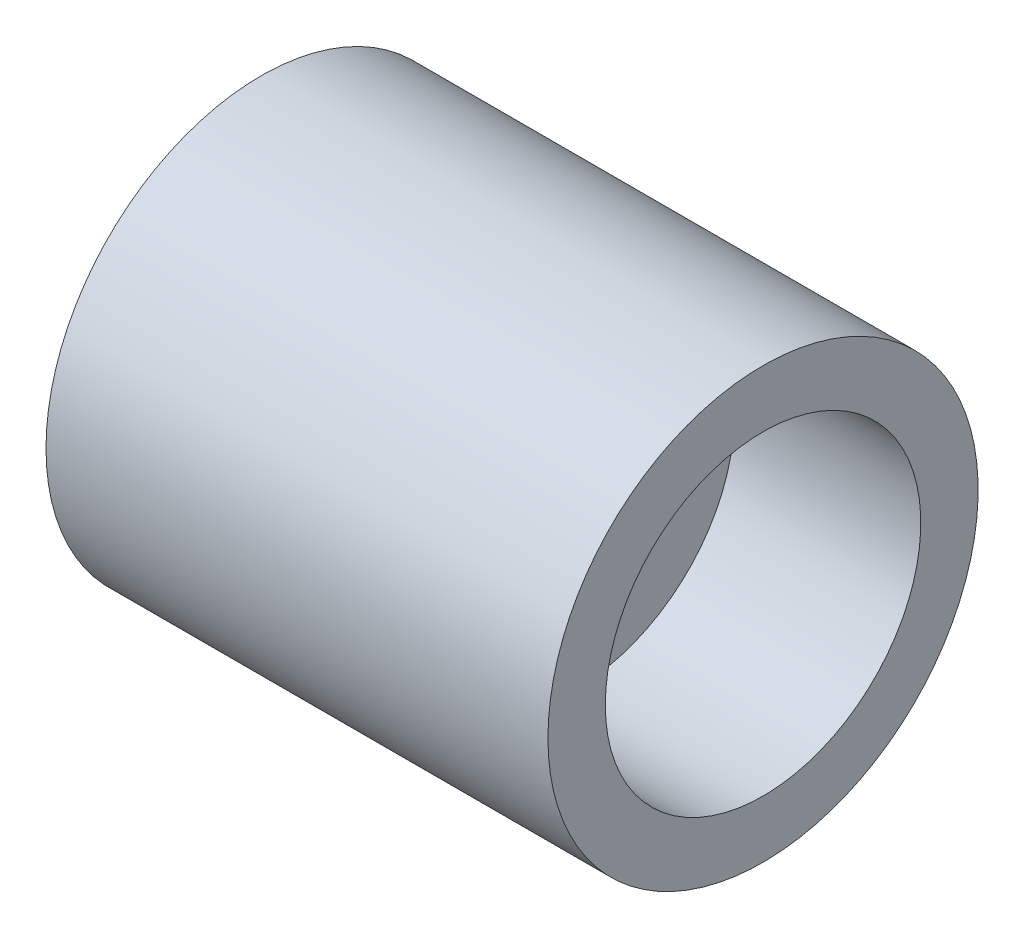
ISO-10303-21;
HEADER;
FILE_DESCRIPTION(('STEP AP214'),'2;1');
FILE_NAME('part.step','',(''),(''),'','','');
FILE_SCHEMA(('AUTOMOTIVE_DESIGN { 1 0 10303 214 1 1 1 1 }'));
ENDSEC;
DATA;
#1=APPLICATION_CONTEXT('core data for automotive mechanical design processes');
#2=APPLICATION_PROTOCOL_DEFINITION('international standard','automotive_design',2000,#1);
#3=PRODUCT_CONTEXT('',#1,'mechanical');
#4=PRODUCT('Part','Part','',(#3));
#5=PRODUCT_RELATED_PRODUCT_CATEGORY('part','',(#4));
#6=PRODUCT_DEFINITION_FORMATION('','',#4);
#7=PRODUCT_DEFINITION_CONTEXT('part definition',#1,'design');
#8=PRODUCT_DEFINITION('design','',#6,#7);
#9=PRODUCT_DEFINITION_SHAPE('','',#8);
#10=(LENGTH_UNIT() NAMED_UNIT(*) SI_UNIT(.MILLI.,.METRE.));
#11=(NAMED_UNIT(*) PLANE_ANGLE_UNIT() SI_UNIT($,.RADIAN.));
#12=(NAMED_UNIT(*) SI_UNIT($,.STERADIAN.) SOLID_ANGLE_UNIT());
#13=UNCERTAINTY_MEASURE_WITH_UNIT(LENGTH_MEASURE(1.E-05),#10,'distance_accuracy_value','');
#14=(GEOMETRIC_REPRESENTATION_CONTEXT(3) GLOBAL_UNCERTAINTY_ASSIGNED_CONTEXT((#13)) GLOBAL_UNIT_ASSIGNED_CONTEXT((#10,
#11,#12)) REPRESENTATION_CONTEXT('',''));
#15=CARTESIAN_POINT('',(0.,0.,0.));
#16=DIRECTION('',(0.,0.,1.));
#17=DIRECTION('',(1.,0.,0.));
#18=AXIS2_PLACEMENT_3D('',#15,#16,#17);
#19=CARTESIAN_POINT('',(35.,0.,0.));
#20=DIRECTION('',(-1.,0.,0.));
#21=DIRECTION('',(0.,0.,1.));
#22=AXIS2_PLACEMENT_3D('',#19,#20,#21);
#23=CYLINDRICAL_SURFACE('',#22,6.25);
#24=CARTESIAN_POINT('',(13.,0.,0.));
#25=DIRECTION('',(-1.,0.,0.));
#26=DIRECTION('',(0.,0.,1.));
#27=AXIS2_PLACEMENT_3D('',#24,#25,#26);
#28=CIRCLE('',#27,6.25);
#29=CARTESIAN_POINT('',(13.,0.,6.25));
#30=VERTEX_POINT('',#29);
#31=EDGE_CURVE('E56',#30,#30,#28,.F.);
#32=ORIENTED_EDGE('',*,*,#31,.F.);
#33=EDGE_LOOP('',(#32));
#34=FACE_BOUND('',#33,.T.);
#35=CARTESIAN_POINT('',(22.,0.,0.));
#36=DIRECTION('',(-1.,0.,0.));
#37=DIRECTION('',(0.,0.,1.));
#38=AXIS2_PLACEMENT_3D('',#35,#36,#37);
#39=CIRCLE('',#38,6.25);
#40=CARTESIAN_POINT('',(22.,0.,6.25));
#41=VERTEX_POINT('',#40);
#42=EDGE_CURVE('E51',#41,#41,#39,.T.);
#43=ORIENTED_EDGE('',*,*,#42,.F.);
#44=EDGE_LOOP('',(#43));
#45=FACE_BOUND('',#44,.T.);
#46=ADVANCED_FACE('F15',(#34,#45),#23,.F.);
#47=CARTESIAN_POINT('',(13.,11.,0.));
#48=DIRECTION('',(-1.,0.,0.));
#49=DIRECTION('',(0.,0.,1.));
#50=AXIS2_PLACEMENT_3D('',#47,#48,#49);
#51=PLANE('',#50);
#52=CARTESIAN_POINT('',(13.,0.,0.));
#53=DIRECTION('',(-1.,0.,0.));
#54=DIRECTION('',(0.,0.,1.));
#55=AXIS2_PLACEMENT_3D('',#52,#53,#54);
#56=CIRCLE('',#55,11.);
#57=CARTESIAN_POINT('',(13.,0.,11.));
#58=VERTEX_POINT('',#57);
#59=EDGE_CURVE('E46',#58,#58,#56,.T.);
#60=ORIENTED_EDGE('',*,*,#59,.T.);
#61=EDGE_LOOP('',(#60));
#62=FACE_BOUND('',#61,.T.);
#63=ORIENTED_EDGE('',*,*,#31,.T.);
#64=EDGE_LOOP('',(#63));
#65=FACE_BOUND('',#64,.T.);
#66=ADVANCED_FACE('F61',(#62,#65),#51,.T.);
#67=CARTESIAN_POINT('',(22.,6.25,0.));
#68=DIRECTION('',(1.,0.,0.));
#69=DIRECTION('',(0.,0.,-1.));
#70=AXIS2_PLACEMENT_3D('',#67,#68,#69);
#71=PLANE('',#70);
#72=ORIENTED_EDGE('',*,*,#42,.T.);
#73=EDGE_LOOP('',(#72));
#74=FACE_BOUND('',#73,.T.);
#75=CARTESIAN_POINT('',(22.,0.,0.));
#76=DIRECTION('',(-1.,0.,0.));
#77=DIRECTION('',(0.,0.,1.));
#78=AXIS2_PLACEMENT_3D('',#75,#76,#77);
#79=CIRCLE('',#78,11.);
#80=CARTESIAN_POINT('',(22.,0.,11.));
#81=VERTEX_POINT('',#80);
#82=EDGE_CURVE('E41',#81,#81,#79,.F.);
#83=ORIENTED_EDGE('',*,*,#82,.T.);
#84=EDGE_LOOP('',(#83));
#85=FACE_BOUND('',#84,.T.);
#86=ADVANCED_FACE('F67',(#74,#85),#71,.T.);
#87=CARTESIAN_POINT('',(35.,0.,0.));
#88=DIRECTION('',(-1.,0.,0.));
#89=DIRECTION('',(0.,0.,1.));
#90=AXIS2_PLACEMENT_3D('',#87,#88,#89);
#91=CYLINDRICAL_SURFACE('',#90,11.);
#92=CARTESIAN_POINT('',(0.,0.,0.));
#93=DIRECTION('',(-1.,0.,0.));
#94=DIRECTION('',(0.,0.,1.));
#95=AXIS2_PLACEMENT_3D('',#92,#93,#94);
#96=CIRCLE('',#95,11.);
#97=CARTESIAN_POINT('',(0.,0.,11.));
#98=VERTEX_POINT('',#97);
#99=EDGE_CURVE('E36',#98,#98,#96,.F.);
#100=ORIENTED_EDGE('',*,*,#99,.F.);
#101=EDGE_LOOP('',(#100));
#102=FACE_BOUND('',#101,.T.);
#103=ORIENTED_EDGE('',*,*,#59,.F.);
#104=EDGE_LOOP('',(#103));
#105=FACE_BOUND('',#104,.T.);
#106=ADVANCED_FACE('F70',(#102,#105),#91,.F.);
#107=CARTESIAN_POINT('',(35.,0.,0.));
#108=DIRECTION('',(-1.,0.,0.));
#109=DIRECTION('',(0.,0.,1.));
#110=AXIS2_PLACEMENT_3D('',#107,#108,#109);
#111=CYLINDRICAL_SURFACE('',#110,11.);
#112=ORIENTED_EDGE('',*,*,#82,.F.);
#113=EDGE_LOOP('',(#112));
#114=FACE_BOUND('',#113,.T.);
#115=CARTESIAN_POINT('',(35.,0.,0.));
#116=DIRECTION('',(-1.,0.,0.));
#117=DIRECTION('',(0.,0.,1.));
#118=AXIS2_PLACEMENT_3D('',#115,#116,#117);
#119=CIRCLE('',#118,11.);
#120=CARTESIAN_POINT('',(35.,0.,11.));
#121=VERTEX_POINT('',#120);
#122=EDGE_CURVE('E27',#121,#121,#119,.T.);
#123=ORIENTED_EDGE('',*,*,#122,.F.);
#124=EDGE_LOOP('',(#123));
#125=FACE_BOUND('',#124,.T.);
#126=ADVANCED_FACE('F74',(#114,#125),#111,.F.);
#127=CARTESIAN_POINT('',(0.,15.,0.));
#128=DIRECTION('',(-1.,0.,0.));
#129=DIRECTION('',(0.,0.,1.));
#130=AXIS2_PLACEMENT_3D('',#127,#128,#129);
#131=PLANE('',#130);
#132=CARTESIAN_POINT('',(0.,0.,0.));
#133=DIRECTION('',(-1.,0.,0.));
#134=DIRECTION('',(0.,0.,1.));
#135=AXIS2_PLACEMENT_3D('',#132,#133,#134);
#136=CIRCLE('',#135,15.);
#137=CARTESIAN_POINT('',(0.,0.,15.));
#138=VERTEX_POINT('',#137);
#139=EDGE_CURVE('E22',#138,#138,#136,.F.);
#140=ORIENTED_EDGE('',*,*,#139,.F.);
#141=EDGE_LOOP('',(#140));
#142=FACE_BOUND('',#141,.T.);
#143=ORIENTED_EDGE('',*,*,#99,.T.);
#144=EDGE_LOOP('',(#143));
#145=FACE_BOUND('',#144,.T.);
#146=ADVANCED_FACE('F77',(#142,#145),#131,.T.);
#147=CARTESIAN_POINT('',(35.,11.,0.));
#148=DIRECTION('',(1.,0.,0.));
#149=DIRECTION('',(0.,0.,-1.));
#150=AXIS2_PLACEMENT_3D('',#147,#148,#149);
#151=PLANE('',#150);
#152=ORIENTED_EDGE('',*,*,#122,.T.);
#153=EDGE_LOOP('',(#152));
#154=FACE_BOUND('',#153,.T.);
#155=CARTESIAN_POINT('',(35.,0.,0.));
#156=DIRECTION('',(-1.,0.,0.));
#157=DIRECTION('',(0.,0.,1.));
#158=AXIS2_PLACEMENT_3D('',#155,#156,#157);
#159=CIRCLE('',#158,15.);
#160=CARTESIAN_POINT('',(35.,0.,15.));
#161=VERTEX_POINT('',#160);
#162=EDGE_CURVE('E10',#161,#161,#159,.T.);
#163=ORIENTED_EDGE('',*,*,#162,.F.);
#164=EDGE_LOOP('',(#163));
#165=FACE_BOUND('',#164,.T.);
#166=ADVANCED_FACE('F81',(#154,#165),#151,.T.);
#167=CARTESIAN_POINT('',(35.,0.,0.));
#168=DIRECTION('',(-1.,0.,0.));
#169=DIRECTION('',(0.,0.,1.));
#170=AXIS2_PLACEMENT_3D('',#167,#168,#169);
#171=CYLINDRICAL_SURFACE('',#170,15.);
#172=ORIENTED_EDGE('',*,*,#162,.T.);
#173=EDGE_LOOP('',(#172));
#174=FACE_BOUND('',#173,.T.);
#175=ORIENTED_EDGE('',*,*,#139,.T.);
#176=EDGE_LOOP('',(#175));
#177=FACE_BOUND('',#176,.T.);
#178=ADVANCED_FACE('F84',(#174,#177),#171,.T.);
#179=CLOSED_SHELL('',(#46,#66,#86,#106,#126,#146,#166,#178));
#180=MANIFOLD_SOLID_BREP('B1',#179);
#181=ADVANCED_BREP_SHAPE_REPRESENTATION('',(#18,#180),#14);
#182=SHAPE_DEFINITION_REPRESENTATION(#9,#181);
ENDSEC;
END-ISO-10303-21;
